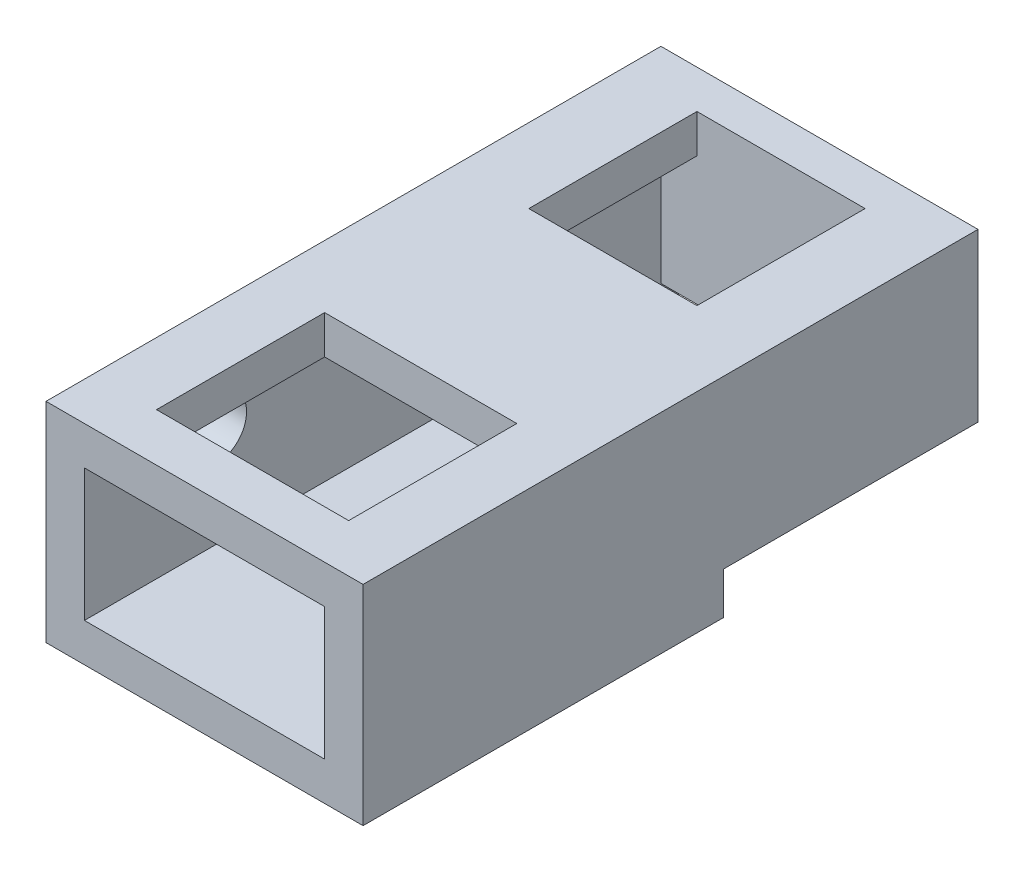
ISO-10303-21;
HEADER;
FILE_DESCRIPTION(('STEP AP214'),'2;1');
FILE_NAME('part.step','',(''),(''),'','','');
FILE_SCHEMA(('AUTOMOTIVE_DESIGN { 1 0 10303 214 1 1 1 1 }'));
ENDSEC;
DATA;
#1=APPLICATION_CONTEXT('core data for automotive mechanical design processes');
#2=APPLICATION_PROTOCOL_DEFINITION('international standard','automotive_design',2000,#1);
#3=PRODUCT_CONTEXT('',#1,'mechanical');
#4=PRODUCT('Part','Part','',(#3));
#5=PRODUCT_RELATED_PRODUCT_CATEGORY('part','',(#4));
#6=PRODUCT_DEFINITION_FORMATION('','',#4);
#7=PRODUCT_DEFINITION_CONTEXT('part definition',#1,'design');
#8=PRODUCT_DEFINITION('design','',#6,#7);
#9=PRODUCT_DEFINITION_SHAPE('','',#8);
#10=(LENGTH_UNIT() NAMED_UNIT(*) SI_UNIT(.MILLI.,.METRE.));
#11=(NAMED_UNIT(*) PLANE_ANGLE_UNIT() SI_UNIT($,.RADIAN.));
#12=(NAMED_UNIT(*) SI_UNIT($,.STERADIAN.) SOLID_ANGLE_UNIT());
#13=UNCERTAINTY_MEASURE_WITH_UNIT(LENGTH_MEASURE(1.E-05),#10,'distance_accuracy_value','');
#14=(GEOMETRIC_REPRESENTATION_CONTEXT(3) GLOBAL_UNCERTAINTY_ASSIGNED_CONTEXT((#13)) GLOBAL_UNIT_ASSIGNED_CONTEXT((#10,
#11,#12)) REPRESENTATION_CONTEXT('',''));
#15=CARTESIAN_POINT('',(0.,0.,0.));
#16=DIRECTION('',(0.,0.,1.));
#17=DIRECTION('',(1.,0.,0.));
#18=AXIS2_PLACEMENT_3D('',#15,#16,#17);
#19=CARTESIAN_POINT('',(-132.,17.5,0.));
#20=DIRECTION('',(0.,1.,0.));
#21=DIRECTION('',(0.,0.,1.));
#22=AXIS2_PLACEMENT_3D('',#19,#20,#21);
#23=PLANE('',#22);
#24=DIRECTION('',(0.,0.,1.));
#25=VECTOR('',#24,1.);
#26=CARTESIAN_POINT('',(-116.,17.5,0.));
#27=LINE('',#26,#25);
#28=CARTESIAN_POINT('',(-116.,17.5,0.));
#29=VERTEX_POINT('',#28);
#30=CARTESIAN_POINT('',(-116.,17.5,16.));
#31=VERTEX_POINT('',#30);
#32=EDGE_CURVE('E11',#29,#31,#27,.T.);
#33=ORIENTED_EDGE('',*,*,#32,.F.);
#34=DIRECTION('',(1.,0.,0.));
#35=VECTOR('',#34,1.);
#36=CARTESIAN_POINT('',(-132.,17.5,0.));
#37=LINE('',#36,#35);
#38=CARTESIAN_POINT('',(0.,17.5,0.));
#39=VERTEX_POINT('',#38);
#40=EDGE_CURVE('E201',#29,#39,#37,.T.);
#41=ORIENTED_EDGE('',*,*,#40,.T.);
#42=DIRECTION('',(0.,0.,1.));
#43=VECTOR('',#42,1.);
#44=CARTESIAN_POINT('',(0.,17.5,0.));
#45=LINE('',#44,#43);
#46=CARTESIAN_POINT('',(0.,17.5,106.));
#47=VERTEX_POINT('',#46);
#48=EDGE_CURVE('E209',#39,#47,#45,.T.);
#49=ORIENTED_EDGE('',*,*,#48,.T.);
#50=DIRECTION('',(1.,0.,0.));
#51=VECTOR('',#50,1.);
#52=CARTESIAN_POINT('',(-132.,17.5,106.));
#53=LINE('',#52,#51);
#54=CARTESIAN_POINT('',(-16.,17.5,106.));
#55=VERTEX_POINT('',#54);
#56=EDGE_CURVE('E218',#55,#47,#53,.T.);
#57=ORIENTED_EDGE('',*,*,#56,.F.);
#58=DIRECTION('',(0.,0.,-1.));
#59=VECTOR('',#58,1.);
#60=CARTESIAN_POINT('',(-16.,17.5,256.));
#61=LINE('',#60,#59);
#62=CARTESIAN_POINT('',(-16.,17.5,16.));
#63=VERTEX_POINT('',#62);
#64=EDGE_CURVE('E56',#55,#63,#61,.T.);
#65=ORIENTED_EDGE('',*,*,#64,.T.);
#66=DIRECTION('',(1.,0.,0.));
#67=VECTOR('',#66,1.);
#68=CARTESIAN_POINT('',(-101.,17.5,16.));
#69=LINE('',#68,#67);
#70=EDGE_CURVE('E41',#31,#63,#69,.T.);
#71=ORIENTED_EDGE('',*,*,#70,.F.);
#72=EDGE_LOOP('',(#33,#41,#49,#57,#65,#71));
#73=FACE_BOUND('',#72,.T.);
#74=ADVANCED_FACE('F33',(#73),#23,.F.);
#75=CARTESIAN_POINT('',(-16.,16.,256.));
#76=DIRECTION('',(-1.,0.,0.));
#77=DIRECTION('',(0.,0.,1.));
#78=AXIS2_PLACEMENT_3D('',#75,#76,#77);
#79=PLANE('',#78);
#80=DIRECTION('',(0.,1.,0.));
#81=VECTOR('',#80,1.);
#82=CARTESIAN_POINT('',(-16.,16.,106.));
#83=LINE('',#82,#81);
#84=CARTESIAN_POINT('',(-16.,16.,106.));
#85=VERTEX_POINT('',#84);
#86=EDGE_CURVE('E224',#85,#55,#83,.T.);
#87=ORIENTED_EDGE('',*,*,#86,.F.);
#88=DIRECTION('',(0.,0.,-1.));
#89=VECTOR('',#88,1.);
#90=CARTESIAN_POINT('',(-16.,16.,256.));
#91=LINE('',#90,#89);
#92=CARTESIAN_POINT('',(-16.,16.,256.));
#93=VERTEX_POINT('',#92);
#94=EDGE_CURVE('E304',#93,#85,#91,.T.);
#95=ORIENTED_EDGE('',*,*,#94,.F.);
#96=DIRECTION('',(0.,1.,0.));
#97=VECTOR('',#96,1.);
#98=CARTESIAN_POINT('',(-16.,16.,256.));
#99=LINE('',#98,#97);
#100=CARTESIAN_POINT('',(-16.,71.,256.));
#101=VERTEX_POINT('',#100);
#102=EDGE_CURVE('E290',#93,#101,#99,.T.);
#103=ORIENTED_EDGE('',*,*,#102,.T.);
#104=DIRECTION('',(0.,0.,-1.));
#105=VECTOR('',#104,1.);
#106=CARTESIAN_POINT('',(-16.,71.,256.));
#107=LINE('',#106,#105);
#108=CARTESIAN_POINT('',(-16.,71.,16.));
#109=VERTEX_POINT('',#108);
#110=EDGE_CURVE('E312',#101,#109,#107,.T.);
#111=ORIENTED_EDGE('',*,*,#110,.T.);
#112=DIRECTION('',(0.,-1.,0.));
#113=VECTOR('',#112,1.);
#114=CARTESIAN_POINT('',(-16.,71.,16.));
#115=LINE('',#114,#113);
#116=EDGE_CURVE('E226',#109,#63,#115,.T.);
#117=ORIENTED_EDGE('',*,*,#116,.T.);
#118=ORIENTED_EDGE('',*,*,#64,.F.);
#119=EDGE_LOOP('',(#87,#95,#103,#111,#117,#118));
#120=FACE_BOUND('',#119,.T.);
#121=ADVANCED_FACE('F349',(#120),#79,.T.);
#122=CARTESIAN_POINT('',(-116.,71.,256.));
#123=DIRECTION('',(0.,-1.,0.));
#124=DIRECTION('',(0.,0.,-1.));
#125=AXIS2_PLACEMENT_3D('',#122,#123,#124);
#126=PLANE('',#125);
#127=DIRECTION('',(1.,0.,0.));
#128=VECTOR('',#127,1.);
#129=CARTESIAN_POINT('',(0.,71.,236.));
#130=LINE('',#129,#128);
#131=CARTESIAN_POINT('',(-106.,71.,236.));
#132=VERTEX_POINT('',#131);
#133=CARTESIAN_POINT('',(-26.,71.,236.));
#134=VERTEX_POINT('',#133);
#135=EDGE_CURVE('E244',#132,#134,#130,.T.);
#136=ORIENTED_EDGE('',*,*,#135,.T.);
#137=DIRECTION('',(0.,0.,-1.));
#138=VECTOR('',#137,1.);
#139=CARTESIAN_POINT('',(-26.,71.,0.));
#140=LINE('',#139,#138);
#141=CARTESIAN_POINT('',(-26.,71.,166.));
#142=VERTEX_POINT('',#141);
#143=EDGE_CURVE('E265',#134,#142,#140,.T.);
#144=ORIENTED_EDGE('',*,*,#143,.T.);
#145=DIRECTION('',(1.,0.,0.));
#146=VECTOR('',#145,1.);
#147=CARTESIAN_POINT('',(0.,71.,166.));
#148=LINE('',#147,#146);
#149=CARTESIAN_POINT('',(-106.,71.,166.));
#150=VERTEX_POINT('',#149);
#151=EDGE_CURVE('E287',#150,#142,#148,.T.);
#152=ORIENTED_EDGE('',*,*,#151,.F.);
#153=DIRECTION('',(0.,0.,-1.));
#154=VECTOR('',#153,1.);
#155=CARTESIAN_POINT('',(-106.,71.,0.));
#156=LINE('',#155,#154);
#157=EDGE_CURVE('E280',#132,#150,#156,.T.);
#158=ORIENTED_EDGE('',*,*,#157,.F.);
#159=EDGE_LOOP('',(#136,#144,#152,#158));
#160=FACE_BOUND('',#159,.T.);
#161=DIRECTION('',(0.,0.,-1.));
#162=VECTOR('',#161,1.);
#163=CARTESIAN_POINT('',(-116.,71.,256.));
#164=LINE('',#163,#162);
#165=CARTESIAN_POINT('',(-116.,71.,256.));
#166=VERTEX_POINT('',#165);
#167=CARTESIAN_POINT('',(-116.,71.,16.));
#168=VERTEX_POINT('',#167);
#169=EDGE_CURVE('E309',#166,#168,#164,.T.);
#170=ORIENTED_EDGE('',*,*,#169,.T.);
#171=DIRECTION('',(1.,0.,0.));
#172=VECTOR('',#171,1.);
#173=CARTESIAN_POINT('',(-16.,71.,16.));
#174=LINE('',#173,#172);
#175=CARTESIAN_POINT('',(-101.,71.,16.));
#176=VERTEX_POINT('',#175);
#177=EDGE_CURVE('E232',#168,#176,#174,.T.);
#178=ORIENTED_EDGE('',*,*,#177,.T.);
#179=DIRECTION('',(0.,0.,1.));
#180=VECTOR('',#179,1.);
#181=CARTESIAN_POINT('',(-101.,71.,16.));
#182=LINE('',#181,#180);
#183=CARTESIAN_POINT('',(-101.,71.,86.));
#184=VERTEX_POINT('',#183);
#185=EDGE_CURVE('E235',#176,#184,#182,.T.);
#186=ORIENTED_EDGE('',*,*,#185,.T.);
#187=DIRECTION('',(1.,0.,0.));
#188=VECTOR('',#187,1.);
#189=CARTESIAN_POINT('',(-101.,71.,86.));
#190=LINE('',#189,#188);
#191=CARTESIAN_POINT('',(-31.,71.,86.));
#192=VERTEX_POINT('',#191);
#193=EDGE_CURVE('E236',#184,#192,#190,.T.);
#194=ORIENTED_EDGE('',*,*,#193,.T.);
#195=DIRECTION('',(0.,0.,-1.));
#196=VECTOR('',#195,1.);
#197=CARTESIAN_POINT('',(-31.,71.,16.));
#198=LINE('',#197,#196);
#199=CARTESIAN_POINT('',(-31.,71.,16.));
#200=VERTEX_POINT('',#199);
#201=EDGE_CURVE('E256',#192,#200,#198,.T.);
#202=ORIENTED_EDGE('',*,*,#201,.T.);
#203=EDGE_CURVE('E231',#200,#109,#174,.T.);
#204=ORIENTED_EDGE('',*,*,#203,.T.);
#205=ORIENTED_EDGE('',*,*,#110,.F.);
#206=DIRECTION('',(-1.,0.,0.));
#207=VECTOR('',#206,1.);
#208=CARTESIAN_POINT('',(-116.,71.,256.));
#209=LINE('',#208,#207);
#210=EDGE_CURVE('E297',#101,#166,#209,.T.);
#211=ORIENTED_EDGE('',*,*,#210,.T.);
#212=EDGE_LOOP('',(#170,#178,#186,#194,#202,#204,#205,#211));
#213=FACE_BOUND('',#212,.T.);
#214=ADVANCED_FACE('F355',(#160,#213),#126,.T.);
#215=CARTESIAN_POINT('',(-116.,16.,256.));
#216=DIRECTION('',(1.,0.,0.));
#217=DIRECTION('',(0.,0.,-1.));
#218=AXIS2_PLACEMENT_3D('',#215,#216,#217);
#219=PLANE('',#218);
#220=CARTESIAN_POINT('',(-116.,57.5,201.));
#221=DIRECTION('',(1.,0.,0.));
#222=DIRECTION('',(0.,0.,-1.));
#223=AXIS2_PLACEMENT_3D('',#220,#221,#222);
#224=CIRCLE('',#223,12.5);
#225=CARTESIAN_POINT('',(-116.,57.5,188.5));
#226=VERTEX_POINT('',#225);
#227=EDGE_CURVE('E468',#226,#226,#224,.F.);
#228=ORIENTED_EDGE('',*,*,#227,.T.);
#229=EDGE_LOOP('',(#228));
#230=FACE_BOUND('',#229,.T.);
#231=DIRECTION('',(0.,0.,-1.));
#232=VECTOR('',#231,1.);
#233=CARTESIAN_POINT('',(-116.,16.,256.));
#234=LINE('',#233,#232);
#235=CARTESIAN_POINT('',(-116.,16.,256.));
#236=VERTEX_POINT('',#235);
#237=CARTESIAN_POINT('',(-116.,16.,106.));
#238=VERTEX_POINT('',#237);
#239=EDGE_CURVE('E307',#236,#238,#234,.T.);
#240=ORIENTED_EDGE('',*,*,#239,.T.);
#241=DIRECTION('',(0.,1.,0.));
#242=VECTOR('',#241,1.);
#243=CARTESIAN_POINT('',(-116.,17.5,106.));
#244=LINE('',#243,#242);
#245=CARTESIAN_POINT('',(-116.,10.,106.));
#246=VERTEX_POINT('',#245);
#247=EDGE_CURVE('E190',#246,#238,#244,.T.);
#248=ORIENTED_EDGE('',*,*,#247,.F.);
#249=DIRECTION('',(0.,0.,1.));
#250=VECTOR('',#249,1.);
#251=CARTESIAN_POINT('',(-116.,10.,0.));
#252=LINE('',#251,#250);
#253=CARTESIAN_POINT('',(-116.,10.,0.));
#254=VERTEX_POINT('',#253);
#255=EDGE_CURVE('E182',#254,#246,#252,.T.);
#256=ORIENTED_EDGE('',*,*,#255,.F.);
#257=DIRECTION('',(0.,-1.,0.));
#258=VECTOR('',#257,1.);
#259=CARTESIAN_POINT('',(-116.,17.5,0.));
#260=LINE('',#259,#258);
#261=EDGE_CURVE('E195',#29,#254,#260,.T.);
#262=ORIENTED_EDGE('',*,*,#261,.F.);
#263=ORIENTED_EDGE('',*,*,#32,.T.);
#264=DIRECTION('',(0.,1.,0.));
#265=VECTOR('',#264,1.);
#266=CARTESIAN_POINT('',(-116.,71.,16.));
#267=LINE('',#266,#265);
#268=EDGE_CURVE('E229',#31,#168,#267,.T.);
#269=ORIENTED_EDGE('',*,*,#268,.T.);
#270=ORIENTED_EDGE('',*,*,#169,.F.);
#271=DIRECTION('',(0.,-1.,0.));
#272=VECTOR('',#271,1.);
#273=CARTESIAN_POINT('',(-116.,16.,256.));
#274=LINE('',#273,#272);
#275=EDGE_CURVE('E299',#166,#236,#274,.T.);
#276=ORIENTED_EDGE('',*,*,#275,.T.);
#277=EDGE_LOOP('',(#240,#248,#256,#262,#263,#269,#270,#276));
#278=FACE_BOUND('',#277,.T.);
#279=ADVANCED_FACE('F194',(#230,#278),#219,.T.);
#280=CARTESIAN_POINT('',(-116.,16.,256.));
#281=DIRECTION('',(0.,1.,0.));
#282=DIRECTION('',(0.,0.,1.));
#283=AXIS2_PLACEMENT_3D('',#280,#281,#282);
#284=PLANE('',#283);
#285=DIRECTION('',(1.,0.,0.));
#286=VECTOR('',#285,1.);
#287=CARTESIAN_POINT('',(-116.,16.,106.));
#288=LINE('',#287,#286);
#289=EDGE_CURVE('E222',#238,#85,#288,.T.);
#290=ORIENTED_EDGE('',*,*,#289,.F.);
#291=ORIENTED_EDGE('',*,*,#239,.F.);
#292=DIRECTION('',(1.,0.,0.));
#293=VECTOR('',#292,1.);
#294=CARTESIAN_POINT('',(-116.,16.,256.));
#295=LINE('',#294,#293);
#296=EDGE_CURVE('E302',#236,#93,#295,.T.);
#297=ORIENTED_EDGE('',*,*,#296,.T.);
#298=ORIENTED_EDGE('',*,*,#94,.T.);
#299=EDGE_LOOP('',(#290,#291,#297,#298));
#300=FACE_BOUND('',#299,.T.);
#301=ADVANCED_FACE('F398',(#300),#284,.T.);
#302=CARTESIAN_POINT('',(0.,0.,256.));
#303=DIRECTION('',(0.,0.,-1.));
#304=DIRECTION('',(-1.,0.,0.));
#305=AXIS2_PLACEMENT_3D('',#302,#303,#304);
#306=PLANE('',#305);
#307=DIRECTION('',(0.,1.,0.));
#308=VECTOR('',#307,1.);
#309=CARTESIAN_POINT('',(0.,0.,256.));
#310=LINE('',#309,#308);
#311=CARTESIAN_POINT('',(0.,0.,256.));
#312=VERTEX_POINT('',#311);
#313=CARTESIAN_POINT('',(0.,87.,256.));
#314=VERTEX_POINT('',#313);
#315=EDGE_CURVE('E316',#312,#314,#310,.T.);
#316=ORIENTED_EDGE('',*,*,#315,.T.);
#317=DIRECTION('',(-1.,0.,0.));
#318=VECTOR('',#317,1.);
#319=CARTESIAN_POINT('',(-132.,87.,256.));
#320=LINE('',#319,#318);
#321=CARTESIAN_POINT('',(-132.,87.,256.));
#322=VERTEX_POINT('',#321);
#323=EDGE_CURVE('E319',#314,#322,#320,.T.);
#324=ORIENTED_EDGE('',*,*,#323,.T.);
#325=DIRECTION('',(0.,-1.,0.));
#326=VECTOR('',#325,1.);
#327=CARTESIAN_POINT('',(-132.,0.,256.));
#328=LINE('',#327,#326);
#329=CARTESIAN_POINT('',(-132.,0.,256.));
#330=VERTEX_POINT('',#329);
#331=EDGE_CURVE('E322',#322,#330,#328,.T.);
#332=ORIENTED_EDGE('',*,*,#331,.T.);
#333=DIRECTION('',(1.,0.,0.));
#334=VECTOR('',#333,1.);
#335=CARTESIAN_POINT('',(-132.,0.,256.));
#336=LINE('',#335,#334);
#337=EDGE_CURVE('E324',#330,#312,#336,.T.);
#338=ORIENTED_EDGE('',*,*,#337,.T.);
#339=EDGE_LOOP('',(#316,#324,#332,#338));
#340=FACE_BOUND('',#339,.T.);
#341=ORIENTED_EDGE('',*,*,#102,.F.);
#342=ORIENTED_EDGE('',*,*,#296,.F.);
#343=ORIENTED_EDGE('',*,*,#275,.F.);
#344=ORIENTED_EDGE('',*,*,#210,.F.);
#345=EDGE_LOOP('',(#341,#342,#343,#344));
#346=FACE_BOUND('',#345,.T.);
#347=ADVANCED_FACE('F359',(#340,#346),#306,.F.);
#348=CARTESIAN_POINT('',(0.,0.,0.));
#349=DIRECTION('',(0.,0.,-1.));
#350=DIRECTION('',(-1.,0.,0.));
#351=AXIS2_PLACEMENT_3D('',#348,#349,#350);
#352=PLANE('',#351);
#353=ORIENTED_EDGE('',*,*,#40,.F.);
#354=ORIENTED_EDGE('',*,*,#261,.T.);
#355=DIRECTION('',(-1.,0.,0.));
#356=VECTOR('',#355,1.);
#357=CARTESIAN_POINT('',(-116.,10.,0.));
#358=LINE('',#357,#356);
#359=CARTESIAN_POINT('',(-132.,10.,0.));
#360=VERTEX_POINT('',#359);
#361=EDGE_CURVE('E179',#254,#360,#358,.T.);
#362=ORIENTED_EDGE('',*,*,#361,.T.);
#363=DIRECTION('',(0.,-1.,0.));
#364=VECTOR('',#363,1.);
#365=CARTESIAN_POINT('',(-132.,0.,0.));
#366=LINE('',#365,#364);
#367=CARTESIAN_POINT('',(-132.,87.,0.));
#368=VERTEX_POINT('',#367);
#369=EDGE_CURVE('E320',#368,#360,#366,.T.);
#370=ORIENTED_EDGE('',*,*,#369,.F.);
#371=DIRECTION('',(-1.,0.,0.));
#372=VECTOR('',#371,1.);
#373=CARTESIAN_POINT('',(-132.,87.,0.));
#374=LINE('',#373,#372);
#375=CARTESIAN_POINT('',(0.,87.,0.));
#376=VERTEX_POINT('',#375);
#377=EDGE_CURVE('E328',#376,#368,#374,.T.);
#378=ORIENTED_EDGE('',*,*,#377,.F.);
#379=DIRECTION('',(0.,1.,0.));
#380=VECTOR('',#379,1.);
#381=CARTESIAN_POINT('',(0.,0.,0.));
#382=LINE('',#381,#380);
#383=EDGE_CURVE('E315',#39,#376,#382,.T.);
#384=ORIENTED_EDGE('',*,*,#383,.F.);
#385=EDGE_LOOP('',(#353,#354,#362,#370,#378,#384));
#386=FACE_BOUND('',#385,.T.);
#387=ADVANCED_FACE('F199',(#386),#352,.T.);
#388=CARTESIAN_POINT('',(0.,0.,256.));
#389=DIRECTION('',(-1.,0.,0.));
#390=DIRECTION('',(0.,0.,1.));
#391=AXIS2_PLACEMENT_3D('',#388,#389,#390);
#392=PLANE('',#391);
#393=DIRECTION('',(0.,0.,-1.));
#394=VECTOR('',#393,1.);
#395=CARTESIAN_POINT('',(0.,0.,256.));
#396=LINE('',#395,#394);
#397=CARTESIAN_POINT('',(0.,0.,106.));
#398=VERTEX_POINT('',#397);
#399=EDGE_CURVE('E326',#312,#398,#396,.T.);
#400=ORIENTED_EDGE('',*,*,#399,.T.);
#401=DIRECTION('',(0.,-1.,0.));
#402=VECTOR('',#401,1.);
#403=CARTESIAN_POINT('',(0.,0.,106.));
#404=LINE('',#403,#402);
#405=EDGE_CURVE('E48',#47,#398,#404,.T.);
#406=ORIENTED_EDGE('',*,*,#405,.F.);
#407=ORIENTED_EDGE('',*,*,#48,.F.);
#408=ORIENTED_EDGE('',*,*,#383,.T.);
#409=DIRECTION('',(0.,0.,-1.));
#410=VECTOR('',#409,1.);
#411=CARTESIAN_POINT('',(0.,87.,256.));
#412=LINE('',#411,#410);
#413=EDGE_CURVE('E339',#314,#376,#412,.T.);
#414=ORIENTED_EDGE('',*,*,#413,.F.);
#415=ORIENTED_EDGE('',*,*,#315,.F.);
#416=EDGE_LOOP('',(#400,#406,#407,#408,#414,#415));
#417=FACE_BOUND('',#416,.T.);
#418=ADVANCED_FACE('F35',(#417),#392,.F.);
#419=CARTESIAN_POINT('',(-132.,87.,256.));
#420=DIRECTION('',(0.,-1.,0.));
#421=DIRECTION('',(1.,0.,0.));
#422=AXIS2_PLACEMENT_3D('',#419,#420,#421);
#423=PLANE('',#422);
#424=DIRECTION('',(1.,0.,0.));
#425=VECTOR('',#424,1.);
#426=CARTESIAN_POINT('',(-101.,87.,86.));
#427=LINE('',#426,#425);
#428=CARTESIAN_POINT('',(-101.,87.,86.));
#429=VERTEX_POINT('',#428);
#430=CARTESIAN_POINT('',(-31.,87.,86.));
#431=VERTEX_POINT('',#430);
#432=EDGE_CURVE('E248',#429,#431,#427,.T.);
#433=ORIENTED_EDGE('',*,*,#432,.F.);
#434=DIRECTION('',(0.,0.,1.));
#435=VECTOR('',#434,1.);
#436=CARTESIAN_POINT('',(-101.,87.,16.));
#437=LINE('',#436,#435);
#438=CARTESIAN_POINT('',(-101.,87.,16.));
#439=VERTEX_POINT('',#438);
#440=EDGE_CURVE('E251',#439,#429,#437,.T.);
#441=ORIENTED_EDGE('',*,*,#440,.F.);
#442=DIRECTION('',(-1.,0.,0.));
#443=VECTOR('',#442,1.);
#444=CARTESIAN_POINT('',(-101.,87.,16.));
#445=LINE('',#444,#443);
#446=CARTESIAN_POINT('',(-31.,87.,16.));
#447=VERTEX_POINT('',#446);
#448=EDGE_CURVE('E241',#447,#439,#445,.T.);
#449=ORIENTED_EDGE('',*,*,#448,.F.);
#450=DIRECTION('',(0.,0.,-1.));
#451=VECTOR('',#450,1.);
#452=CARTESIAN_POINT('',(-31.,87.,16.));
#453=LINE('',#452,#451);
#454=EDGE_CURVE('E245',#431,#447,#453,.T.);
#455=ORIENTED_EDGE('',*,*,#454,.F.);
#456=EDGE_LOOP('',(#433,#441,#449,#455));
#457=FACE_BOUND('',#456,.T.);
#458=DIRECTION('',(0.,0.,-1.));
#459=VECTOR('',#458,1.);
#460=CARTESIAN_POINT('',(-26.,87.,0.));
#461=LINE('',#460,#459);
#462=CARTESIAN_POINT('',(-26.,87.,236.));
#463=VERTEX_POINT('',#462);
#464=CARTESIAN_POINT('',(-26.,87.,166.));
#465=VERTEX_POINT('',#464);
#466=EDGE_CURVE('E277',#463,#465,#461,.T.);
#467=ORIENTED_EDGE('',*,*,#466,.F.);
#468=DIRECTION('',(1.,0.,0.));
#469=VECTOR('',#468,1.);
#470=CARTESIAN_POINT('',(0.,87.,236.));
#471=LINE('',#470,#469);
#472=CARTESIAN_POINT('',(-106.,87.,236.));
#473=VERTEX_POINT('',#472);
#474=EDGE_CURVE('E281',#473,#463,#471,.T.);
#475=ORIENTED_EDGE('',*,*,#474,.F.);
#476=DIRECTION('',(0.,0.,-1.));
#477=VECTOR('',#476,1.);
#478=CARTESIAN_POINT('',(-106.,87.,0.));
#479=LINE('',#478,#477);
#480=CARTESIAN_POINT('',(-106.,87.,166.));
#481=VERTEX_POINT('',#480);
#482=EDGE_CURVE('E270',#473,#481,#479,.T.);
#483=ORIENTED_EDGE('',*,*,#482,.T.);
#484=DIRECTION('',(1.,0.,0.));
#485=VECTOR('',#484,1.);
#486=CARTESIAN_POINT('',(0.,87.,166.));
#487=LINE('',#486,#485);
#488=EDGE_CURVE('E269',#481,#465,#487,.T.);
#489=ORIENTED_EDGE('',*,*,#488,.T.);
#490=EDGE_LOOP('',(#467,#475,#483,#489));
#491=FACE_BOUND('',#490,.T.);
#492=ORIENTED_EDGE('',*,*,#377,.T.);
#493=DIRECTION('',(0.,0.,-1.));
#494=VECTOR('',#493,1.);
#495=CARTESIAN_POINT('',(-132.,87.,256.));
#496=LINE('',#495,#494);
#497=EDGE_CURVE('E336',#322,#368,#496,.T.);
#498=ORIENTED_EDGE('',*,*,#497,.F.);
#499=ORIENTED_EDGE('',*,*,#323,.F.);
#500=ORIENTED_EDGE('',*,*,#413,.T.);
#501=EDGE_LOOP('',(#492,#498,#499,#500));
#502=FACE_BOUND('',#501,.T.);
#503=ADVANCED_FACE('F375',(#457,#491,#502),#423,.F.);
#504=CARTESIAN_POINT('',(-132.,0.,256.));
#505=DIRECTION('',(1.,0.,0.));
#506=DIRECTION('',(0.,0.,-1.));
#507=AXIS2_PLACEMENT_3D('',#504,#505,#506);
#508=PLANE('',#507);
#509=CARTESIAN_POINT('',(-132.,57.5,201.));
#510=DIRECTION('',(-1.,0.,0.));
#511=DIRECTION('',(0.,0.,1.));
#512=AXIS2_PLACEMENT_3D('',#509,#510,#511);
#513=CIRCLE('',#512,12.5);
#514=CARTESIAN_POINT('',(-132.,57.5,213.5));
#515=VERTEX_POINT('',#514);
#516=EDGE_CURVE('E203',#515,#515,#513,.T.);
#517=ORIENTED_EDGE('',*,*,#516,.F.);
#518=EDGE_LOOP('',(#517));
#519=FACE_BOUND('',#518,.T.);
#520=DIRECTION('',(0.,0.,1.));
#521=VECTOR('',#520,1.);
#522=CARTESIAN_POINT('',(-132.,10.,0.));
#523=LINE('',#522,#521);
#524=CARTESIAN_POINT('',(-132.,10.,106.));
#525=VERTEX_POINT('',#524);
#526=EDGE_CURVE('E185',#360,#525,#523,.T.);
#527=ORIENTED_EDGE('',*,*,#526,.T.);
#528=DIRECTION('',(0.,-1.,0.));
#529=VECTOR('',#528,1.);
#530=CARTESIAN_POINT('',(-132.,0.,106.));
#531=LINE('',#530,#529);
#532=CARTESIAN_POINT('',(-132.,0.,106.));
#533=VERTEX_POINT('',#532);
#534=EDGE_CURVE('E211',#525,#533,#531,.T.);
#535=ORIENTED_EDGE('',*,*,#534,.T.);
#536=DIRECTION('',(0.,0.,-1.));
#537=VECTOR('',#536,1.);
#538=CARTESIAN_POINT('',(-132.,0.,256.));
#539=LINE('',#538,#537);
#540=EDGE_CURVE('E333',#330,#533,#539,.T.);
#541=ORIENTED_EDGE('',*,*,#540,.F.);
#542=ORIENTED_EDGE('',*,*,#331,.F.);
#543=ORIENTED_EDGE('',*,*,#497,.T.);
#544=ORIENTED_EDGE('',*,*,#369,.T.);
#545=EDGE_LOOP('',(#527,#535,#541,#542,#543,#544));
#546=FACE_BOUND('',#545,.T.);
#547=ADVANCED_FACE('F378',(#519,#546),#508,.F.);
#548=CARTESIAN_POINT('',(-132.,0.,256.));
#549=DIRECTION('',(0.,1.,0.));
#550=DIRECTION('',(0.,0.,1.));
#551=AXIS2_PLACEMENT_3D('',#548,#549,#550);
#552=PLANE('',#551);
#553=ORIENTED_EDGE('',*,*,#540,.T.);
#554=DIRECTION('',(1.,0.,0.));
#555=VECTOR('',#554,1.);
#556=CARTESIAN_POINT('',(-132.,0.,106.));
#557=LINE('',#556,#555);
#558=EDGE_CURVE('E216',#533,#398,#557,.T.);
#559=ORIENTED_EDGE('',*,*,#558,.T.);
#560=ORIENTED_EDGE('',*,*,#399,.F.);
#561=ORIENTED_EDGE('',*,*,#337,.F.);
#562=EDGE_LOOP('',(#553,#559,#560,#561));
#563=FACE_BOUND('',#562,.T.);
#564=ADVANCED_FACE('F439',(#563),#552,.F.);
#565=CARTESIAN_POINT('',(0.,-0.001000000000001,236.));
#566=DIRECTION('',(0.,0.,1.));
#567=DIRECTION('',(1.,0.,0.));
#568=AXIS2_PLACEMENT_3D('',#565,#566,#567);
#569=PLANE('',#568);
#570=DIRECTION('',(0.,1.,0.));
#571=VECTOR('',#570,1.);
#572=CARTESIAN_POINT('',(-106.,-0.001000000000001,236.));
#573=LINE('',#572,#571);
#574=EDGE_CURVE('E274',#132,#473,#573,.T.);
#575=ORIENTED_EDGE('',*,*,#574,.T.);
#576=ORIENTED_EDGE('',*,*,#474,.T.);
#577=DIRECTION('',(0.,1.,0.));
#578=VECTOR('',#577,1.);
#579=CARTESIAN_POINT('',(-26.,-0.001000000000001,236.));
#580=LINE('',#579,#578);
#581=EDGE_CURVE('E285',#134,#463,#580,.T.);
#582=ORIENTED_EDGE('',*,*,#581,.F.);
#583=ORIENTED_EDGE('',*,*,#135,.F.);
#584=EDGE_LOOP('',(#575,#576,#582,#583));
#585=FACE_BOUND('',#584,.T.);
#586=ADVANCED_FACE('F436',(#585),#569,.F.);
#587=CARTESIAN_POINT('',(-106.,-0.001000000000001,0.));
#588=DIRECTION('',(1.,0.,0.));
#589=DIRECTION('',(0.,0.,-1.));
#590=AXIS2_PLACEMENT_3D('',#587,#588,#589);
#591=PLANE('',#590);
#592=ORIENTED_EDGE('',*,*,#157,.T.);
#593=DIRECTION('',(0.,1.,0.));
#594=VECTOR('',#593,1.);
#595=CARTESIAN_POINT('',(-106.,-0.001000000000001,166.));
#596=LINE('',#595,#594);
#597=EDGE_CURVE('E273',#150,#481,#596,.T.);
#598=ORIENTED_EDGE('',*,*,#597,.T.);
#599=ORIENTED_EDGE('',*,*,#482,.F.);
#600=ORIENTED_EDGE('',*,*,#574,.F.);
#601=EDGE_LOOP('',(#592,#598,#599,#600));
#602=FACE_BOUND('',#601,.T.);
#603=ADVANCED_FACE('F433',(#602),#591,.T.);
#604=CARTESIAN_POINT('',(0.,-0.001000000000001,166.));
#605=DIRECTION('',(0.,0.,1.));
#606=DIRECTION('',(1.,0.,0.));
#607=AXIS2_PLACEMENT_3D('',#604,#605,#606);
#608=PLANE('',#607);
#609=ORIENTED_EDGE('',*,*,#151,.T.);
#610=DIRECTION('',(0.,1.,0.));
#611=VECTOR('',#610,1.);
#612=CARTESIAN_POINT('',(-26.,-0.001000000000001,166.));
#613=LINE('',#612,#611);
#614=EDGE_CURVE('E268',#142,#465,#613,.T.);
#615=ORIENTED_EDGE('',*,*,#614,.T.);
#616=ORIENTED_EDGE('',*,*,#488,.F.);
#617=ORIENTED_EDGE('',*,*,#597,.F.);
#618=EDGE_LOOP('',(#609,#615,#616,#617));
#619=FACE_BOUND('',#618,.T.);
#620=ADVANCED_FACE('F429',(#619),#608,.T.);
#621=CARTESIAN_POINT('',(-26.,-0.001000000000001,0.));
#622=DIRECTION('',(1.,0.,0.));
#623=DIRECTION('',(0.,0.,-1.));
#624=AXIS2_PLACEMENT_3D('',#621,#622,#623);
#625=PLANE('',#624);
#626=ORIENTED_EDGE('',*,*,#581,.T.);
#627=ORIENTED_EDGE('',*,*,#466,.T.);
#628=ORIENTED_EDGE('',*,*,#614,.F.);
#629=ORIENTED_EDGE('',*,*,#143,.F.);
#630=EDGE_LOOP('',(#626,#627,#628,#629));
#631=FACE_BOUND('',#630,.T.);
#632=ADVANCED_FACE('F426',(#631),#625,.F.);
#633=CARTESIAN_POINT('',(-101.,-0.001000000000001,16.));
#634=DIRECTION('',(-1.,0.,0.));
#635=DIRECTION('',(0.,0.,1.));
#636=AXIS2_PLACEMENT_3D('',#633,#634,#635);
#637=PLANE('',#636);
#638=DIRECTION('',(0.,1.,0.));
#639=VECTOR('',#638,1.);
#640=CARTESIAN_POINT('',(-101.,-0.001000000000001,16.));
#641=LINE('',#640,#639);
#642=EDGE_CURVE('E259',#176,#439,#641,.T.);
#643=ORIENTED_EDGE('',*,*,#642,.T.);
#644=ORIENTED_EDGE('',*,*,#440,.T.);
#645=DIRECTION('',(0.,1.,0.));
#646=VECTOR('',#645,1.);
#647=CARTESIAN_POINT('',(-101.,-0.001000000000001,86.));
#648=LINE('',#647,#646);
#649=EDGE_CURVE('E255',#184,#429,#648,.T.);
#650=ORIENTED_EDGE('',*,*,#649,.F.);
#651=ORIENTED_EDGE('',*,*,#185,.F.);
#652=EDGE_LOOP('',(#643,#644,#650,#651));
#653=FACE_BOUND('',#652,.T.);
#654=ADVANCED_FACE('F366',(#653),#637,.F.);
#655=CARTESIAN_POINT('',(-101.,-0.001000000000001,16.));
#656=DIRECTION('',(0.,0.,-1.));
#657=DIRECTION('',(-1.,0.,0.));
#658=AXIS2_PLACEMENT_3D('',#655,#656,#657);
#659=PLANE('',#658);
#660=ORIENTED_EDGE('',*,*,#268,.F.);
#661=ORIENTED_EDGE('',*,*,#70,.T.);
#662=ORIENTED_EDGE('',*,*,#116,.F.);
#663=ORIENTED_EDGE('',*,*,#203,.F.);
#664=DIRECTION('',(0.,1.,0.));
#665=VECTOR('',#664,1.);
#666=CARTESIAN_POINT('',(-31.,-0.001000000000001,16.));
#667=LINE('',#666,#665);
#668=EDGE_CURVE('E240',#200,#447,#667,.T.);
#669=ORIENTED_EDGE('',*,*,#668,.T.);
#670=ORIENTED_EDGE('',*,*,#448,.T.);
#671=ORIENTED_EDGE('',*,*,#642,.F.);
#672=ORIENTED_EDGE('',*,*,#177,.F.);
#673=EDGE_LOOP('',(#660,#661,#662,#663,#669,#670,#671,#672));
#674=FACE_BOUND('',#673,.T.);
#675=ADVANCED_FACE('F344',(#674),#659,.F.);
#676=CARTESIAN_POINT('',(-31.,-0.001000000000001,16.));
#677=DIRECTION('',(1.,0.,0.));
#678=DIRECTION('',(0.,0.,-1.));
#679=AXIS2_PLACEMENT_3D('',#676,#677,#678);
#680=PLANE('',#679);
#681=DIRECTION('',(0.,1.,0.));
#682=VECTOR('',#681,1.);
#683=CARTESIAN_POINT('',(-31.,-0.001000000000001,86.));
#684=LINE('',#683,#682);
#685=EDGE_CURVE('E239',#192,#431,#684,.T.);
#686=ORIENTED_EDGE('',*,*,#685,.T.);
#687=ORIENTED_EDGE('',*,*,#454,.T.);
#688=ORIENTED_EDGE('',*,*,#668,.F.);
#689=ORIENTED_EDGE('',*,*,#201,.F.);
#690=EDGE_LOOP('',(#686,#687,#688,#689));
#691=FACE_BOUND('',#690,.T.);
#692=ADVANCED_FACE('F373',(#691),#680,.F.);
#693=CARTESIAN_POINT('',(-101.,-0.001000000000001,86.));
#694=DIRECTION('',(0.,0.,1.));
#695=DIRECTION('',(1.,0.,0.));
#696=AXIS2_PLACEMENT_3D('',#693,#694,#695);
#697=PLANE('',#696);
#698=ORIENTED_EDGE('',*,*,#649,.T.);
#699=ORIENTED_EDGE('',*,*,#432,.T.);
#700=ORIENTED_EDGE('',*,*,#685,.F.);
#701=ORIENTED_EDGE('',*,*,#193,.F.);
#702=EDGE_LOOP('',(#698,#699,#700,#701));
#703=FACE_BOUND('',#702,.T.);
#704=ADVANCED_FACE('F369',(#703),#697,.F.);
#705=CARTESIAN_POINT('',(-132.,0.,106.));
#706=DIRECTION('',(0.,0.,1.));
#707=DIRECTION('',(1.,0.,0.));
#708=AXIS2_PLACEMENT_3D('',#705,#706,#707);
#709=PLANE('',#708);
#710=ORIENTED_EDGE('',*,*,#534,.F.);
#711=DIRECTION('',(-1.,0.,0.));
#712=VECTOR('',#711,1.);
#713=CARTESIAN_POINT('',(-116.,10.,106.));
#714=LINE('',#713,#712);
#715=EDGE_CURVE('E189',#246,#525,#714,.T.);
#716=ORIENTED_EDGE('',*,*,#715,.F.);
#717=ORIENTED_EDGE('',*,*,#247,.T.);
#718=ORIENTED_EDGE('',*,*,#289,.T.);
#719=ORIENTED_EDGE('',*,*,#86,.T.);
#720=ORIENTED_EDGE('',*,*,#56,.T.);
#721=ORIENTED_EDGE('',*,*,#405,.T.);
#722=ORIENTED_EDGE('',*,*,#558,.F.);
#723=EDGE_LOOP('',(#710,#716,#717,#718,#719,#720,#721,#722));
#724=FACE_BOUND('',#723,.T.);
#725=ADVANCED_FACE('F395',(#724),#709,.F.);
#726=CARTESIAN_POINT('',(-116.,10.,0.));
#727=DIRECTION('',(0.,-1.,0.));
#728=DIRECTION('',(0.,0.,-1.));
#729=AXIS2_PLACEMENT_3D('',#726,#727,#728);
#730=PLANE('',#729);
#731=ORIENTED_EDGE('',*,*,#526,.F.);
#732=ORIENTED_EDGE('',*,*,#361,.F.);
#733=ORIENTED_EDGE('',*,*,#255,.T.);
#734=ORIENTED_EDGE('',*,*,#715,.T.);
#735=EDGE_LOOP('',(#731,#732,#733,#734));
#736=FACE_BOUND('',#735,.T.);
#737=ADVANCED_FACE('F181',(#736),#730,.T.);
#738=CARTESIAN_POINT('',(0.001000000000001,57.5,201.));
#739=DIRECTION('',(-1.,0.,0.));
#740=DIRECTION('',(0.,0.,1.));
#741=AXIS2_PLACEMENT_3D('',#738,#739,#740);
#742=CYLINDRICAL_SURFACE('',#741,12.5);
#743=ORIENTED_EDGE('',*,*,#227,.F.);
#744=EDGE_LOOP('',(#743));
#745=FACE_BOUND('',#744,.T.);
#746=ORIENTED_EDGE('',*,*,#516,.T.);
#747=EDGE_LOOP('',(#746));
#748=FACE_BOUND('',#747,.T.);
#749=ADVANCED_FACE('F472',(#745,#748),#742,.F.);
#750=CLOSED_SHELL('',(#74,#121,#214,#279,#301,#347,#387,#418,#503,#547,#564,#586,#603,#620,#632,
#654,#675,#692,#704,#725,#737,#749));
#751=MANIFOLD_SOLID_BREP('B2',#750);
#752=ADVANCED_BREP_SHAPE_REPRESENTATION('',(#18,#751),#14);
#753=SHAPE_DEFINITION_REPRESENTATION(#9,#752);
ENDSEC;
END-ISO-10303-21;
